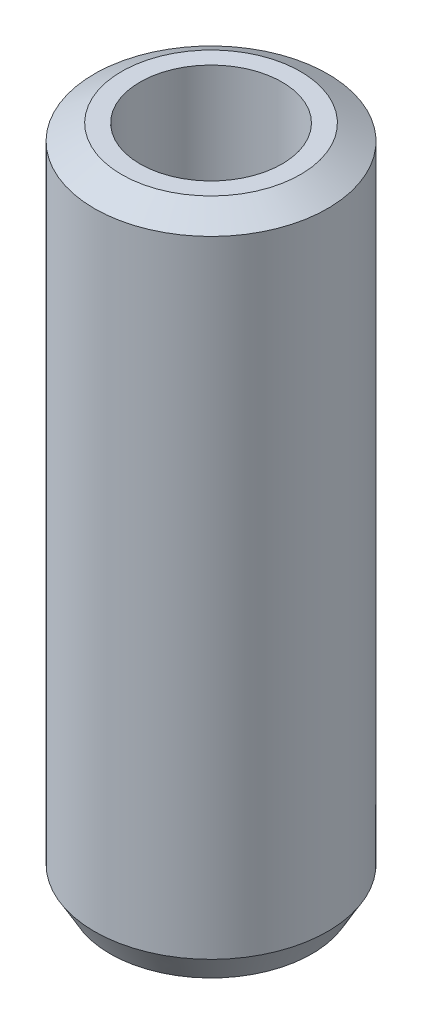
ISO-10303-21;
HEADER;
FILE_DESCRIPTION(('STEP AP214'),'2;1');
FILE_NAME('part.step','',(''),(''),'','','');
FILE_SCHEMA(('AUTOMOTIVE_DESIGN { 1 0 10303 214 1 1 1 1 }'));
ENDSEC;
DATA;
#1=APPLICATION_CONTEXT('core data for automotive mechanical design processes');
#2=APPLICATION_PROTOCOL_DEFINITION('international standard','automotive_design',2000,#1);
#3=PRODUCT_CONTEXT('',#1,'mechanical');
#4=PRODUCT('Part','Part','',(#3));
#5=PRODUCT_RELATED_PRODUCT_CATEGORY('part','',(#4));
#6=PRODUCT_DEFINITION_FORMATION('','',#4);
#7=PRODUCT_DEFINITION_CONTEXT('part definition',#1,'design');
#8=PRODUCT_DEFINITION('design','',#6,#7);
#9=PRODUCT_DEFINITION_SHAPE('','',#8);
#10=(LENGTH_UNIT() NAMED_UNIT(*) SI_UNIT(.MILLI.,.METRE.));
#11=(NAMED_UNIT(*) PLANE_ANGLE_UNIT() SI_UNIT($,.RADIAN.));
#12=(NAMED_UNIT(*) SI_UNIT($,.STERADIAN.) SOLID_ANGLE_UNIT());
#13=UNCERTAINTY_MEASURE_WITH_UNIT(LENGTH_MEASURE(1.E-05),#10,'distance_accuracy_value','');
#14=(GEOMETRIC_REPRESENTATION_CONTEXT(3) GLOBAL_UNCERTAINTY_ASSIGNED_CONTEXT((#13)) GLOBAL_UNIT_ASSIGNED_CONTEXT((#10,
#11,#12)) REPRESENTATION_CONTEXT('',''));
#15=CARTESIAN_POINT('',(0.,0.,0.));
#16=DIRECTION('',(0.,0.,1.));
#17=DIRECTION('',(1.,0.,0.));
#18=AXIS2_PLACEMENT_3D('',#15,#16,#17);
#19=CARTESIAN_POINT('',(0.,100.360531213018,0.));
#20=DIRECTION('',(0.,-1.,0.));
#21=DIRECTION('',(0.,0.,-1.));
#22=AXIS2_PLACEMENT_3D('',#19,#20,#21);
#23=CYLINDRICAL_SURFACE('',#22,17.5);
#24=CARTESIAN_POINT('',(0.,97.9980025858394,0.));
#25=DIRECTION('',(0.,1.,0.));
#26=DIRECTION('',(0.,0.,1.));
#27=AXIS2_PLACEMENT_3D('',#24,#25,#26);
#28=CIRCLE('',#27,17.5);
#29=CARTESIAN_POINT('',(0.,97.9980025858394,17.5));
#30=VERTEX_POINT('',#29);
#31=EDGE_CURVE('E50',#30,#30,#28,.F.);
#32=ORIENTED_EDGE('',*,*,#31,.T.);
#33=EDGE_LOOP('',(#32));
#34=FACE_BOUND('',#33,.T.);
#35=CARTESIAN_POINT('',(0.,4.09201961660872,0.));
#36=DIRECTION('',(0.,1.,0.));
#37=DIRECTION('',(0.,0.,1.));
#38=AXIS2_PLACEMENT_3D('',#35,#36,#37);
#39=CIRCLE('',#38,17.5);
#40=CARTESIAN_POINT('',(0.,4.09201961660872,17.5));
#41=VERTEX_POINT('',#40);
#42=EDGE_CURVE('E51',#41,#41,#39,.T.);
#43=ORIENTED_EDGE('',*,*,#42,.T.);
#44=EDGE_LOOP('',(#43));
#45=FACE_BOUND('',#44,.T.);
#46=ADVANCED_FACE('F39',(#34,#45),#23,.T.);
#47=CARTESIAN_POINT('',(0.,100.360531213018,0.));
#48=DIRECTION('',(0.,1.,0.));
#49=DIRECTION('',(0.,0.,1.));
#50=AXIS2_PLACEMENT_3D('',#47,#48,#49);
#51=PLANE('',#50);
#52=CARTESIAN_POINT('',(0.,100.360531213018,0.));
#53=DIRECTION('',(0.,1.,0.));
#54=DIRECTION('',(0.,0.,1.));
#55=AXIS2_PLACEMENT_3D('',#52,#53,#54);
#56=CIRCLE('',#55,13.4079803833913);
#57=CARTESIAN_POINT('',(0.,100.360531213018,13.4079803833913));
#58=VERTEX_POINT('',#57);
#59=EDGE_CURVE('E54',#58,#58,#56,.T.);
#60=ORIENTED_EDGE('',*,*,#59,.T.);
#61=EDGE_LOOP('',(#60));
#62=FACE_BOUND('',#61,.T.);
#63=CARTESIAN_POINT('',(0.,100.360531213018,0.));
#64=DIRECTION('',(0.,1.,0.));
#65=DIRECTION('',(0.,0.,1.));
#66=AXIS2_PLACEMENT_3D('',#63,#64,#65);
#67=CIRCLE('',#66,10.6529935469935);
#68=CARTESIAN_POINT('',(0.,100.360531213018,10.6529935469935));
#69=VERTEX_POINT('',#68);
#70=EDGE_CURVE('E58',#69,#69,#67,.T.);
#71=ORIENTED_EDGE('',*,*,#70,.F.);
#72=EDGE_LOOP('',(#71));
#73=FACE_BOUND('',#72,.T.);
#74=ADVANCED_FACE('F69',(#62,#73),#51,.T.);
#75=CARTESIAN_POINT('',(0.,0.,0.));
#76=DIRECTION('',(0.,1.,0.));
#77=DIRECTION('',(0.,0.,1.));
#78=AXIS2_PLACEMENT_3D('',#75,#76,#77);
#79=PLANE('',#78);
#80=CARTESIAN_POINT('',(0.,0.,0.));
#81=DIRECTION('',(0.,1.,0.));
#82=DIRECTION('',(0.,0.,1.));
#83=AXIS2_PLACEMENT_3D('',#80,#81,#82);
#84=CIRCLE('',#83,15.1374713728217);
#85=CARTESIAN_POINT('',(0.,0.,15.1374713728217));
#86=VERTEX_POINT('',#85);
#87=EDGE_CURVE('E10',#86,#86,#84,.F.);
#88=ORIENTED_EDGE('',*,*,#87,.T.);
#89=EDGE_LOOP('',(#88));
#90=FACE_BOUND('',#89,.T.);
#91=CARTESIAN_POINT('',(0.,0.,0.));
#92=DIRECTION('',(0.,1.,0.));
#93=DIRECTION('',(0.,0.,1.));
#94=AXIS2_PLACEMENT_3D('',#91,#92,#93);
#95=CIRCLE('',#94,10.6529935469935);
#96=CARTESIAN_POINT('',(0.,0.,10.6529935469935));
#97=VERTEX_POINT('',#96);
#98=EDGE_CURVE('E63',#97,#97,#95,.T.);
#99=ORIENTED_EDGE('',*,*,#98,.T.);
#100=EDGE_LOOP('',(#99));
#101=FACE_BOUND('',#100,.T.);
#102=ADVANCED_FACE('F75',(#90,#101),#79,.F.);
#103=CARTESIAN_POINT('',(0.,100.360531213018,0.));
#104=DIRECTION('',(0.,-1.,0.));
#105=DIRECTION('',(0.,0.,-1.));
#106=AXIS2_PLACEMENT_3D('',#103,#104,#105);
#107=CYLINDRICAL_SURFACE('',#106,10.6529935469935);
#108=ORIENTED_EDGE('',*,*,#70,.T.);
#109=EDGE_LOOP('',(#108));
#110=FACE_BOUND('',#109,.T.);
#111=ORIENTED_EDGE('',*,*,#98,.F.);
#112=EDGE_LOOP('',(#111));
#113=FACE_BOUND('',#112,.T.);
#114=ADVANCED_FACE('F70',(#110,#113),#107,.F.);
#115=CARTESIAN_POINT('',(0.,100.360531213018,0.));
#116=DIRECTION('',(0.,-1.,0.));
#117=DIRECTION('',(0.,0.,-1.));
#118=AXIS2_PLACEMENT_3D('',#115,#116,#117);
#119=CONICAL_SURFACE('',#118,13.4079803833913,1.04719755119659);
#120=ORIENTED_EDGE('',*,*,#31,.F.);
#121=EDGE_LOOP('',(#120));
#122=FACE_BOUND('',#121,.T.);
#123=ORIENTED_EDGE('',*,*,#59,.F.);
#124=EDGE_LOOP('',(#123));
#125=FACE_BOUND('',#124,.T.);
#126=ADVANCED_FACE('F81',(#122,#125),#119,.T.);
#127=CARTESIAN_POINT('',(0.,4.09201961660872,0.));
#128=DIRECTION('',(0.,1.,0.));
#129=DIRECTION('',(0.,0.,1.));
#130=AXIS2_PLACEMENT_3D('',#127,#128,#129);
#131=CONICAL_SURFACE('',#130,17.5,0.523598775598303);
#132=ORIENTED_EDGE('',*,*,#87,.F.);
#133=EDGE_LOOP('',(#132));
#134=FACE_BOUND('',#133,.T.);
#135=ORIENTED_EDGE('',*,*,#42,.F.);
#136=EDGE_LOOP('',(#135));
#137=FACE_BOUND('',#136,.T.);
#138=ADVANCED_FACE('F45',(#134,#137),#131,.T.);
#139=CLOSED_SHELL('',(#46,#74,#102,#114,#126,#138));
#140=MANIFOLD_SOLID_BREP('B2',#139);
#141=ADVANCED_BREP_SHAPE_REPRESENTATION('',(#18,#140),#14);
#142=SHAPE_DEFINITION_REPRESENTATION(#9,#141);
ENDSEC;
END-ISO-10303-21;
